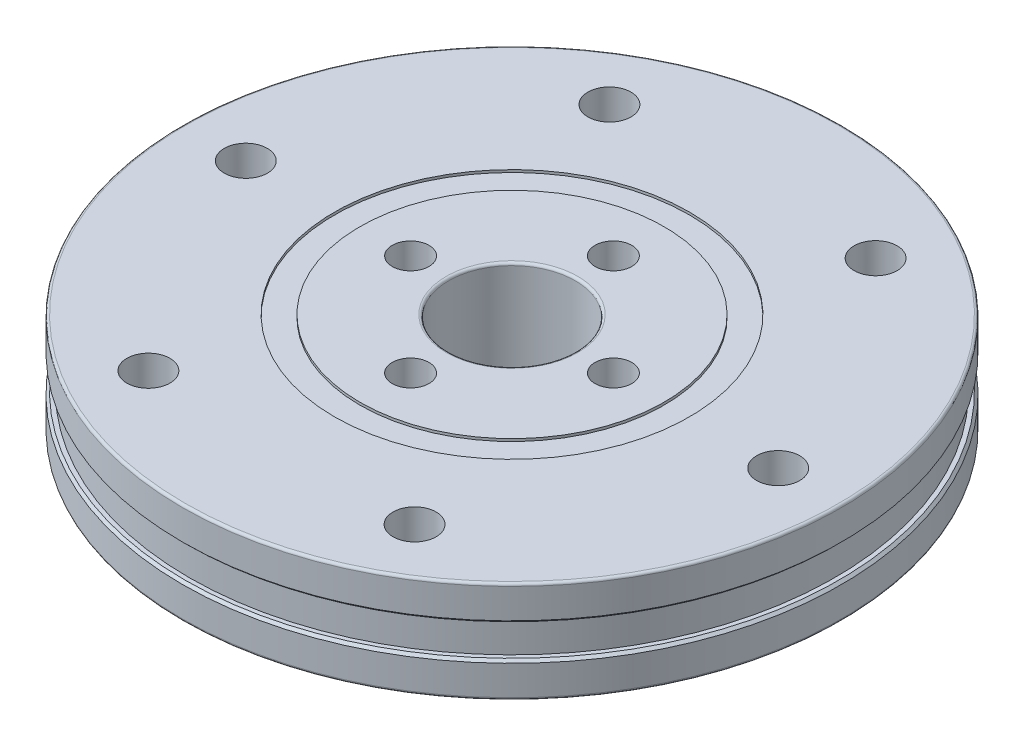
ISO-10303-21;
HEADER;
FILE_DESCRIPTION(('STEP AP214'),'2;1');
FILE_NAME('part.step','',(''),(''),'','','');
FILE_SCHEMA(('AUTOMOTIVE_DESIGN { 1 0 10303 214 1 1 1 1 }'));
ENDSEC;
DATA;
#1=APPLICATION_CONTEXT('core data for automotive mechanical design processes');
#2=APPLICATION_PROTOCOL_DEFINITION('international standard','automotive_design',2000,#1);
#3=PRODUCT_CONTEXT('',#1,'mechanical');
#4=PRODUCT('Part','Part','',(#3));
#5=PRODUCT_RELATED_PRODUCT_CATEGORY('part','',(#4));
#6=PRODUCT_DEFINITION_FORMATION('','',#4);
#7=PRODUCT_DEFINITION_CONTEXT('part definition',#1,'design');
#8=PRODUCT_DEFINITION('design','',#6,#7);
#9=PRODUCT_DEFINITION_SHAPE('','',#8);
#10=(LENGTH_UNIT() NAMED_UNIT(*) SI_UNIT(.MILLI.,.METRE.));
#11=(NAMED_UNIT(*) PLANE_ANGLE_UNIT() SI_UNIT($,.RADIAN.));
#12=(NAMED_UNIT(*) SI_UNIT($,.STERADIAN.) SOLID_ANGLE_UNIT());
#13=UNCERTAINTY_MEASURE_WITH_UNIT(LENGTH_MEASURE(1.E-05),#10,'distance_accuracy_value','');
#14=(GEOMETRIC_REPRESENTATION_CONTEXT(3) GLOBAL_UNCERTAINTY_ASSIGNED_CONTEXT((#13)) GLOBAL_UNIT_ASSIGNED_CONTEXT((#10,
#11,#12)) REPRESENTATION_CONTEXT('',''));
#15=CARTESIAN_POINT('',(0.,0.,0.));
#16=DIRECTION('',(0.,0.,1.));
#17=DIRECTION('',(1.,0.,0.));
#18=AXIS2_PLACEMENT_3D('',#15,#16,#17);
#19=CARTESIAN_POINT('',(10.5,4.,-18.1865334794732));
#20=DIRECTION('',(0.,-1.,0.));
#21=DIRECTION('',(0.,0.,-1.));
#22=AXIS2_PLACEMENT_3D('',#19,#20,#21);
#23=CYLINDRICAL_SURFACE('',#22,1.7);
#24=CARTESIAN_POINT('',(10.5,4.,-18.1865334794732));
#25=DIRECTION('',(0.,1.,0.));
#26=DIRECTION('',(0.,0.,1.));
#27=AXIS2_PLACEMENT_3D('',#24,#25,#26);
#28=CIRCLE('',#27,1.7);
#29=CARTESIAN_POINT('',(10.5,4.,-16.4865334794732));
#30=VERTEX_POINT('',#29);
#31=EDGE_CURVE('E157',#30,#30,#28,.T.);
#32=ORIENTED_EDGE('',*,*,#31,.T.);
#33=EDGE_LOOP('',(#32));
#34=FACE_BOUND('',#33,.T.);
#35=CARTESIAN_POINT('',(10.5,-0.7,-18.1865334794732));
#36=DIRECTION('',(0.,-1.,0.));
#37=DIRECTION('',(0.,0.,-1.));
#38=AXIS2_PLACEMENT_3D('',#35,#36,#37);
#39=CIRCLE('',#38,1.7);
#40=CARTESIAN_POINT('',(10.5,-0.7,-19.8865334794732));
#41=VERTEX_POINT('',#40);
#42=EDGE_CURVE('E52',#41,#41,#39,.T.);
#43=ORIENTED_EDGE('',*,*,#42,.T.);
#44=EDGE_LOOP('',(#43));
#45=FACE_BOUND('',#44,.T.);
#46=ADVANCED_FACE('F48',(#34,#45),#23,.F.);
#47=CARTESIAN_POINT('',(-10.5,4.,-18.1865334794732));
#48=DIRECTION('',(0.,-1.,0.));
#49=DIRECTION('',(0.,0.,-1.));
#50=AXIS2_PLACEMENT_3D('',#47,#48,#49);
#51=CYLINDRICAL_SURFACE('',#50,1.7);
#52=CARTESIAN_POINT('',(-10.5,4.,-18.1865334794732));
#53=DIRECTION('',(0.,1.,0.));
#54=DIRECTION('',(0.,0.,1.));
#55=AXIS2_PLACEMENT_3D('',#52,#53,#54);
#56=CIRCLE('',#55,1.7);
#57=CARTESIAN_POINT('',(-10.5,4.,-16.4865334794732));
#58=VERTEX_POINT('',#57);
#59=EDGE_CURVE('E154',#58,#58,#56,.T.);
#60=ORIENTED_EDGE('',*,*,#59,.T.);
#61=EDGE_LOOP('',(#60));
#62=FACE_BOUND('',#61,.T.);
#63=CARTESIAN_POINT('',(-10.5,-0.7,-18.1865334794732));
#64=DIRECTION('',(0.,-1.,0.));
#65=DIRECTION('',(0.,0.,-1.));
#66=AXIS2_PLACEMENT_3D('',#63,#64,#65);
#67=CIRCLE('',#66,1.7);
#68=CARTESIAN_POINT('',(-10.5,-0.7,-19.8865334794732));
#69=VERTEX_POINT('',#68);
#70=EDGE_CURVE('E77',#69,#69,#67,.T.);
#71=ORIENTED_EDGE('',*,*,#70,.T.);
#72=EDGE_LOOP('',(#71));
#73=FACE_BOUND('',#72,.T.);
#74=ADVANCED_FACE('F217',(#62,#73),#51,.F.);
#75=CARTESIAN_POINT('',(21.,4.,0.));
#76=DIRECTION('',(0.,-1.,0.));
#77=DIRECTION('',(0.,0.,-1.));
#78=AXIS2_PLACEMENT_3D('',#75,#76,#77);
#79=CYLINDRICAL_SURFACE('',#78,1.7);
#80=CARTESIAN_POINT('',(21.,4.,0.));
#81=DIRECTION('',(0.,1.,0.));
#82=DIRECTION('',(0.,0.,1.));
#83=AXIS2_PLACEMENT_3D('',#80,#81,#82);
#84=CIRCLE('',#83,1.7);
#85=CARTESIAN_POINT('',(21.,4.,1.69999999999999));
#86=VERTEX_POINT('',#85);
#87=EDGE_CURVE('E151',#86,#86,#84,.T.);
#88=ORIENTED_EDGE('',*,*,#87,.T.);
#89=EDGE_LOOP('',(#88));
#90=FACE_BOUND('',#89,.T.);
#91=CARTESIAN_POINT('',(21.,-0.7,0.));
#92=DIRECTION('',(0.,-1.,0.));
#93=DIRECTION('',(0.,0.,-1.));
#94=AXIS2_PLACEMENT_3D('',#91,#92,#93);
#95=CIRCLE('',#94,1.7);
#96=CARTESIAN_POINT('',(21.,-0.7,-1.70000000000001));
#97=VERTEX_POINT('',#96);
#98=EDGE_CURVE('E75',#97,#97,#95,.T.);
#99=ORIENTED_EDGE('',*,*,#98,.T.);
#100=EDGE_LOOP('',(#99));
#101=FACE_BOUND('',#100,.T.);
#102=ADVANCED_FACE('F222',(#90,#101),#79,.F.);
#103=CARTESIAN_POINT('',(10.5,4.,18.1865334794732));
#104=DIRECTION('',(0.,-1.,0.));
#105=DIRECTION('',(0.,0.,-1.));
#106=AXIS2_PLACEMENT_3D('',#103,#104,#105);
#107=CYLINDRICAL_SURFACE('',#106,1.7);
#108=CARTESIAN_POINT('',(10.5,4.,18.1865334794732));
#109=DIRECTION('',(0.,1.,0.));
#110=DIRECTION('',(0.,0.,1.));
#111=AXIS2_PLACEMENT_3D('',#108,#109,#110);
#112=CIRCLE('',#111,1.7);
#113=CARTESIAN_POINT('',(10.5,4.,19.8865334794732));
#114=VERTEX_POINT('',#113);
#115=EDGE_CURVE('E148',#114,#114,#112,.T.);
#116=ORIENTED_EDGE('',*,*,#115,.T.);
#117=EDGE_LOOP('',(#116));
#118=FACE_BOUND('',#117,.T.);
#119=CARTESIAN_POINT('',(10.5,-0.7,18.1865334794732));
#120=DIRECTION('',(0.,-1.,0.));
#121=DIRECTION('',(0.,0.,-1.));
#122=AXIS2_PLACEMENT_3D('',#119,#120,#121);
#123=CIRCLE('',#122,1.7);
#124=CARTESIAN_POINT('',(10.5,-0.7,16.4865334794732));
#125=VERTEX_POINT('',#124);
#126=EDGE_CURVE('E72',#125,#125,#123,.T.);
#127=ORIENTED_EDGE('',*,*,#126,.T.);
#128=EDGE_LOOP('',(#127));
#129=FACE_BOUND('',#128,.T.);
#130=ADVANCED_FACE('F228',(#118,#129),#107,.F.);
#131=CARTESIAN_POINT('',(-10.5,4.,18.1865334794732));
#132=DIRECTION('',(0.,-1.,0.));
#133=DIRECTION('',(0.,0.,-1.));
#134=AXIS2_PLACEMENT_3D('',#131,#132,#133);
#135=CYLINDRICAL_SURFACE('',#134,1.7);
#136=CARTESIAN_POINT('',(-10.5,4.,18.1865334794732));
#137=DIRECTION('',(0.,1.,0.));
#138=DIRECTION('',(0.,0.,1.));
#139=AXIS2_PLACEMENT_3D('',#136,#137,#138);
#140=CIRCLE('',#139,1.7);
#141=CARTESIAN_POINT('',(-10.5,4.,19.8865334794732));
#142=VERTEX_POINT('',#141);
#143=EDGE_CURVE('E145',#142,#142,#140,.T.);
#144=ORIENTED_EDGE('',*,*,#143,.T.);
#145=EDGE_LOOP('',(#144));
#146=FACE_BOUND('',#145,.T.);
#147=CARTESIAN_POINT('',(-10.5,-0.7,18.1865334794732));
#148=DIRECTION('',(0.,-1.,0.));
#149=DIRECTION('',(0.,0.,-1.));
#150=AXIS2_PLACEMENT_3D('',#147,#148,#149);
#151=CIRCLE('',#150,1.7);
#152=CARTESIAN_POINT('',(-10.5,-0.7,16.4865334794732));
#153=VERTEX_POINT('',#152);
#154=EDGE_CURVE('E68',#153,#153,#151,.T.);
#155=ORIENTED_EDGE('',*,*,#154,.T.);
#156=EDGE_LOOP('',(#155));
#157=FACE_BOUND('',#156,.T.);
#158=ADVANCED_FACE('F232',(#146,#157),#135,.F.);
#159=CARTESIAN_POINT('',(-21.,4.,0.));
#160=DIRECTION('',(0.,-1.,0.));
#161=DIRECTION('',(0.,0.,-1.));
#162=AXIS2_PLACEMENT_3D('',#159,#160,#161);
#163=CYLINDRICAL_SURFACE('',#162,1.7);
#164=CARTESIAN_POINT('',(-21.,4.,0.));
#165=DIRECTION('',(0.,1.,0.));
#166=DIRECTION('',(0.,0.,1.));
#167=AXIS2_PLACEMENT_3D('',#164,#165,#166);
#168=CIRCLE('',#167,1.7);
#169=CARTESIAN_POINT('',(-21.,4.,1.7));
#170=VERTEX_POINT('',#169);
#171=EDGE_CURVE('E140',#170,#170,#168,.T.);
#172=ORIENTED_EDGE('',*,*,#171,.T.);
#173=EDGE_LOOP('',(#172));
#174=FACE_BOUND('',#173,.T.);
#175=CARTESIAN_POINT('',(-21.,-0.7,0.));
#176=DIRECTION('',(0.,-1.,0.));
#177=DIRECTION('',(0.,0.,-1.));
#178=AXIS2_PLACEMENT_3D('',#175,#176,#177);
#179=CIRCLE('',#178,1.7);
#180=CARTESIAN_POINT('',(-21.,-0.7,-1.7));
#181=VERTEX_POINT('',#180);
#182=EDGE_CURVE('E65',#181,#181,#179,.T.);
#183=ORIENTED_EDGE('',*,*,#182,.T.);
#184=EDGE_LOOP('',(#183));
#185=FACE_BOUND('',#184,.T.);
#186=ADVANCED_FACE('F236',(#174,#185),#163,.F.);
#187=CARTESIAN_POINT('',(0.,4.,0.));
#188=DIRECTION('',(0.,-1.,0.));
#189=DIRECTION('',(0.,0.,-1.));
#190=AXIS2_PLACEMENT_3D('',#187,#188,#189);
#191=CYLINDRICAL_SURFACE('',#190,26.);
#192=CARTESIAN_POINT('',(0.,-3.8,0.));
#193=DIRECTION('',(0.,1.,0.));
#194=DIRECTION('',(0.,0.,1.));
#195=AXIS2_PLACEMENT_3D('',#192,#193,#194);
#196=CIRCLE('',#195,26.);
#197=CARTESIAN_POINT('',(0.,-3.8,26.));
#198=VERTEX_POINT('',#197);
#199=EDGE_CURVE('E181',#198,#198,#196,.T.);
#200=ORIENTED_EDGE('',*,*,#199,.T.);
#201=EDGE_LOOP('',(#200));
#202=FACE_BOUND('',#201,.T.);
#203=CARTESIAN_POINT('',(0.,-1.45,0.));
#204=DIRECTION('',(0.,1.,0.));
#205=DIRECTION('',(0.,0.,1.));
#206=AXIS2_PLACEMENT_3D('',#203,#204,#205);
#207=CIRCLE('',#206,26.);
#208=CARTESIAN_POINT('',(0.,-1.45,26.));
#209=VERTEX_POINT('',#208);
#210=EDGE_CURVE('E163',#209,#209,#207,.F.);
#211=ORIENTED_EDGE('',*,*,#210,.T.);
#212=EDGE_LOOP('',(#211));
#213=FACE_BOUND('',#212,.T.);
#214=ADVANCED_FACE('F213',(#202,#213),#191,.T.);
#215=CARTESIAN_POINT('',(0.,-4.,0.));
#216=DIRECTION('',(0.,1.,0.));
#217=DIRECTION('',(0.,0.,1.));
#218=AXIS2_PLACEMENT_3D('',#215,#216,#217);
#219=PLANE('',#218);
#220=CARTESIAN_POINT('',(0.,-4.,0.));
#221=DIRECTION('',(0.,1.,0.));
#222=DIRECTION('',(0.,0.,1.));
#223=AXIS2_PLACEMENT_3D('',#220,#221,#222);
#224=CIRCLE('',#223,5.2);
#225=CARTESIAN_POINT('',(0.,-4.,5.2));
#226=VERTEX_POINT('',#225);
#227=EDGE_CURVE('E172',#226,#226,#224,.T.);
#228=ORIENTED_EDGE('',*,*,#227,.T.);
#229=EDGE_LOOP('',(#228));
#230=FACE_BOUND('',#229,.T.);
#231=CARTESIAN_POINT('',(-7.99999999999999,-4.,0.));
#232=DIRECTION('',(0.,1.,0.));
#233=DIRECTION('',(0.,0.,1.));
#234=AXIS2_PLACEMENT_3D('',#231,#232,#233);
#235=CIRCLE('',#234,1.45);
#236=CARTESIAN_POINT('',(-7.99999999999999,-4.,1.45));
#237=VERTEX_POINT('',#236);
#238=EDGE_CURVE('E116',#237,#237,#235,.T.);
#239=ORIENTED_EDGE('',*,*,#238,.T.);
#240=EDGE_LOOP('',(#239));
#241=FACE_BOUND('',#240,.T.);
#242=CARTESIAN_POINT('',(0.,-4.,8.));
#243=DIRECTION('',(0.,1.,0.));
#244=DIRECTION('',(0.,0.,1.));
#245=AXIS2_PLACEMENT_3D('',#242,#243,#244);
#246=CIRCLE('',#245,1.45);
#247=CARTESIAN_POINT('',(0.,-4.,9.45));
#248=VERTEX_POINT('',#247);
#249=EDGE_CURVE('E122',#248,#248,#246,.T.);
#250=ORIENTED_EDGE('',*,*,#249,.T.);
#251=EDGE_LOOP('',(#250));
#252=FACE_BOUND('',#251,.T.);
#253=CARTESIAN_POINT('',(0.,-4.,-7.99999999999999));
#254=DIRECTION('',(0.,1.,0.));
#255=DIRECTION('',(0.,0.,1.));
#256=AXIS2_PLACEMENT_3D('',#253,#254,#255);
#257=CIRCLE('',#256,1.45);
#258=CARTESIAN_POINT('',(0.,-4.,-6.54999999999999));
#259=VERTEX_POINT('',#258);
#260=EDGE_CURVE('E128',#259,#259,#257,.T.);
#261=ORIENTED_EDGE('',*,*,#260,.T.);
#262=EDGE_LOOP('',(#261));
#263=FACE_BOUND('',#262,.T.);
#264=CARTESIAN_POINT('',(7.99999999999999,-4.,0.));
#265=DIRECTION('',(0.,1.,0.));
#266=DIRECTION('',(0.,0.,1.));
#267=AXIS2_PLACEMENT_3D('',#264,#265,#266);
#268=CIRCLE('',#267,1.45);
#269=CARTESIAN_POINT('',(7.99999999999999,-4.,1.45000000000001));
#270=VERTEX_POINT('',#269);
#271=EDGE_CURVE('E134',#270,#270,#268,.T.);
#272=ORIENTED_EDGE('',*,*,#271,.T.);
#273=EDGE_LOOP('',(#272));
#274=FACE_BOUND('',#273,.T.);
#275=CARTESIAN_POINT('',(0.,-4.,0.));
#276=DIRECTION('',(0.,-1.,0.));
#277=DIRECTION('',(0.,0.,-1.));
#278=AXIS2_PLACEMENT_3D('',#275,#276,#277);
#279=CIRCLE('',#278,12.);
#280=CARTESIAN_POINT('',(0.,-4.,-12.));
#281=VERTEX_POINT('',#280);
#282=EDGE_CURVE('E91',#281,#281,#279,.T.);
#283=ORIENTED_EDGE('',*,*,#282,.T.);
#284=EDGE_LOOP('',(#283));
#285=FACE_BOUND('',#284,.T.);
#286=ADVANCED_FACE('F383',(#230,#241,#252,#263,#274,#285),#219,.F.);
#287=CARTESIAN_POINT('',(0.,4.,0.));
#288=DIRECTION('',(0.,1.,0.));
#289=DIRECTION('',(0.,0.,1.));
#290=AXIS2_PLACEMENT_3D('',#287,#288,#289);
#291=PLANE('',#290);
#292=CARTESIAN_POINT('',(0.,4.,0.));
#293=DIRECTION('',(0.,1.,0.));
#294=DIRECTION('',(0.,0.,1.));
#295=AXIS2_PLACEMENT_3D('',#292,#293,#294);
#296=CIRCLE('',#295,5.2);
#297=CARTESIAN_POINT('',(0.,4.,5.2));
#298=VERTEX_POINT('',#297);
#299=EDGE_CURVE('E61',#298,#298,#296,.F.);
#300=ORIENTED_EDGE('',*,*,#299,.T.);
#301=EDGE_LOOP('',(#300));
#302=FACE_BOUND('',#301,.T.);
#303=CARTESIAN_POINT('',(-7.99999999999999,4.,0.));
#304=DIRECTION('',(0.,1.,0.));
#305=DIRECTION('',(0.,0.,1.));
#306=AXIS2_PLACEMENT_3D('',#303,#304,#305);
#307=CIRCLE('',#306,1.45);
#308=CARTESIAN_POINT('',(-7.99999999999999,4.,1.45));
#309=VERTEX_POINT('',#308);
#310=EDGE_CURVE('E119',#309,#309,#307,.T.);
#311=ORIENTED_EDGE('',*,*,#310,.F.);
#312=EDGE_LOOP('',(#311));
#313=FACE_BOUND('',#312,.T.);
#314=CARTESIAN_POINT('',(0.,4.,-7.99999999999999));
#315=DIRECTION('',(0.,1.,0.));
#316=DIRECTION('',(0.,0.,1.));
#317=AXIS2_PLACEMENT_3D('',#314,#315,#316);
#318=CIRCLE('',#317,1.45);
#319=CARTESIAN_POINT('',(0.,4.,-6.54999999999999));
#320=VERTEX_POINT('',#319);
#321=EDGE_CURVE('E131',#320,#320,#318,.T.);
#322=ORIENTED_EDGE('',*,*,#321,.F.);
#323=EDGE_LOOP('',(#322));
#324=FACE_BOUND('',#323,.T.);
#325=CARTESIAN_POINT('',(7.99999999999999,4.,0.));
#326=DIRECTION('',(0.,1.,0.));
#327=DIRECTION('',(0.,0.,1.));
#328=AXIS2_PLACEMENT_3D('',#325,#326,#327);
#329=CIRCLE('',#328,1.45);
#330=CARTESIAN_POINT('',(7.99999999999999,4.,1.45000000000001));
#331=VERTEX_POINT('',#330);
#332=EDGE_CURVE('E137',#331,#331,#329,.T.);
#333=ORIENTED_EDGE('',*,*,#332,.F.);
#334=EDGE_LOOP('',(#333));
#335=FACE_BOUND('',#334,.T.);
#336=CARTESIAN_POINT('',(0.,4.,8.));
#337=DIRECTION('',(0.,1.,0.));
#338=DIRECTION('',(0.,0.,1.));
#339=AXIS2_PLACEMENT_3D('',#336,#337,#338);
#340=CIRCLE('',#339,1.45);
#341=CARTESIAN_POINT('',(0.,4.,9.45));
#342=VERTEX_POINT('',#341);
#343=EDGE_CURVE('E125',#342,#342,#340,.T.);
#344=ORIENTED_EDGE('',*,*,#343,.F.);
#345=EDGE_LOOP('',(#344));
#346=FACE_BOUND('',#345,.T.);
#347=CARTESIAN_POINT('',(0.,4.,0.));
#348=DIRECTION('',(0.,1.,0.));
#349=DIRECTION('',(0.,0.,1.));
#350=AXIS2_PLACEMENT_3D('',#347,#348,#349);
#351=CIRCLE('',#350,12.);
#352=CARTESIAN_POINT('',(0.,4.,12.));
#353=VERTEX_POINT('',#352);
#354=EDGE_CURVE('E104',#353,#353,#351,.T.);
#355=ORIENTED_EDGE('',*,*,#354,.T.);
#356=EDGE_LOOP('',(#355));
#357=FACE_BOUND('',#356,.T.);
#358=ADVANCED_FACE('F189',(#302,#313,#324,#335,#346,#357),#291,.T.);
#359=CARTESIAN_POINT('',(0.,4.,0.));
#360=DIRECTION('',(0.,1.,0.));
#361=DIRECTION('',(0.,0.,1.));
#362=AXIS2_PLACEMENT_3D('',#359,#360,#361);
#363=CIRCLE('',#362,25.8);
#364=CARTESIAN_POINT('',(0.,4.,25.8));
#365=VERTEX_POINT('',#364);
#366=EDGE_CURVE('E56',#365,#365,#363,.T.);
#367=ORIENTED_EDGE('',*,*,#366,.T.);
#368=EDGE_LOOP('',(#367));
#369=FACE_BOUND('',#368,.T.);
#370=CARTESIAN_POINT('',(0.,4.,0.));
#371=DIRECTION('',(0.,1.,0.));
#372=DIRECTION('',(0.,0.,1.));
#373=AXIS2_PLACEMENT_3D('',#370,#371,#372);
#374=CIRCLE('',#373,14.);
#375=CARTESIAN_POINT('',(0.,4.,14.));
#376=VERTEX_POINT('',#375);
#377=EDGE_CURVE('E110',#376,#376,#374,.T.);
#378=ORIENTED_EDGE('',*,*,#377,.F.);
#379=EDGE_LOOP('',(#378));
#380=FACE_BOUND('',#379,.T.);
#381=ORIENTED_EDGE('',*,*,#143,.F.);
#382=EDGE_LOOP('',(#381));
#383=FACE_BOUND('',#382,.T.);
#384=ORIENTED_EDGE('',*,*,#87,.F.);
#385=EDGE_LOOP('',(#384));
#386=FACE_BOUND('',#385,.T.);
#387=ORIENTED_EDGE('',*,*,#31,.F.);
#388=EDGE_LOOP('',(#387));
#389=FACE_BOUND('',#388,.T.);
#390=ORIENTED_EDGE('',*,*,#59,.F.);
#391=EDGE_LOOP('',(#390));
#392=FACE_BOUND('',#391,.T.);
#393=ORIENTED_EDGE('',*,*,#115,.F.);
#394=EDGE_LOOP('',(#393));
#395=FACE_BOUND('',#394,.T.);
#396=ORIENTED_EDGE('',*,*,#171,.F.);
#397=EDGE_LOOP('',(#396));
#398=FACE_BOUND('',#397,.T.);
#399=ADVANCED_FACE('F380',(#369,#380,#383,#386,#389,#392,#395,#398),#291,.T.);
#400=CARTESIAN_POINT('',(-21.,-4.,0.));
#401=DIRECTION('',(0.,-1.,0.));
#402=DIRECTION('',(0.,0.,-1.));
#403=AXIS2_PLACEMENT_3D('',#400,#401,#402);
#404=CIRCLE('',#403,3.25);
#405=CARTESIAN_POINT('',(-21.,-4.,-3.25));
#406=VERTEX_POINT('',#405);
#407=EDGE_CURVE('E342',#406,#406,#404,.T.);
#408=ORIENTED_EDGE('',*,*,#407,.F.);
#409=EDGE_LOOP('',(#408));
#410=FACE_BOUND('',#409,.T.);
#411=CARTESIAN_POINT('',(-10.5,-4.,18.1865334794732));
#412=DIRECTION('',(0.,-1.,0.));
#413=DIRECTION('',(0.,0.,-1.));
#414=AXIS2_PLACEMENT_3D('',#411,#412,#413);
#415=CIRCLE('',#414,3.25);
#416=CARTESIAN_POINT('',(-10.5,-4.,14.9365334794732));
#417=VERTEX_POINT('',#416);
#418=EDGE_CURVE('E352',#417,#417,#415,.T.);
#419=ORIENTED_EDGE('',*,*,#418,.F.);
#420=EDGE_LOOP('',(#419));
#421=FACE_BOUND('',#420,.T.);
#422=CARTESIAN_POINT('',(10.5,-4.,18.1865334794732));
#423=DIRECTION('',(0.,-1.,0.));
#424=DIRECTION('',(0.,0.,-1.));
#425=AXIS2_PLACEMENT_3D('',#422,#423,#424);
#426=CIRCLE('',#425,3.25);
#427=CARTESIAN_POINT('',(10.5,-4.,14.9365334794732));
#428=VERTEX_POINT('',#427);
#429=EDGE_CURVE('E351',#428,#428,#426,.T.);
#430=ORIENTED_EDGE('',*,*,#429,.F.);
#431=EDGE_LOOP('',(#430));
#432=FACE_BOUND('',#431,.T.);
#433=CARTESIAN_POINT('',(21.,-4.,0.));
#434=DIRECTION('',(0.,-1.,0.));
#435=DIRECTION('',(0.,0.,-1.));
#436=AXIS2_PLACEMENT_3D('',#433,#434,#435);
#437=CIRCLE('',#436,3.25);
#438=CARTESIAN_POINT('',(21.,-4.,-3.25000000000001));
#439=VERTEX_POINT('',#438);
#440=EDGE_CURVE('E369',#439,#439,#437,.T.);
#441=ORIENTED_EDGE('',*,*,#440,.F.);
#442=EDGE_LOOP('',(#441));
#443=FACE_BOUND('',#442,.T.);
#444=CARTESIAN_POINT('',(10.5,-4.,-18.1865334794732));
#445=DIRECTION('',(0.,-1.,0.));
#446=DIRECTION('',(0.,0.,-1.));
#447=AXIS2_PLACEMENT_3D('',#444,#445,#446);
#448=CIRCLE('',#447,3.25);
#449=CARTESIAN_POINT('',(10.5,-4.,-21.4365334794732));
#450=VERTEX_POINT('',#449);
#451=EDGE_CURVE('E363',#450,#450,#448,.T.);
#452=ORIENTED_EDGE('',*,*,#451,.F.);
#453=EDGE_LOOP('',(#452));
#454=FACE_BOUND('',#453,.T.);
#455=CARTESIAN_POINT('',(-10.5,-4.,-18.1865334794732));
#456=DIRECTION('',(0.,-1.,0.));
#457=DIRECTION('',(0.,0.,-1.));
#458=AXIS2_PLACEMENT_3D('',#455,#456,#457);
#459=CIRCLE('',#458,3.25);
#460=CARTESIAN_POINT('',(-10.5,-4.,-21.4365334794732));
#461=VERTEX_POINT('',#460);
#462=EDGE_CURVE('E357',#461,#461,#459,.T.);
#463=ORIENTED_EDGE('',*,*,#462,.F.);
#464=EDGE_LOOP('',(#463));
#465=FACE_BOUND('',#464,.T.);
#466=CARTESIAN_POINT('',(0.,-4.,0.));
#467=DIRECTION('',(0.,1.,0.));
#468=DIRECTION('',(0.,0.,1.));
#469=AXIS2_PLACEMENT_3D('',#466,#467,#468);
#470=CIRCLE('',#469,25.8);
#471=CARTESIAN_POINT('',(0.,-4.,25.8));
#472=VERTEX_POINT('',#471);
#473=EDGE_CURVE('E184',#472,#472,#470,.F.);
#474=ORIENTED_EDGE('',*,*,#473,.T.);
#475=EDGE_LOOP('',(#474));
#476=FACE_BOUND('',#475,.T.);
#477=CARTESIAN_POINT('',(0.,-4.,0.));
#478=DIRECTION('',(0.,-1.,0.));
#479=DIRECTION('',(0.,0.,-1.));
#480=AXIS2_PLACEMENT_3D('',#477,#478,#479);
#481=CIRCLE('',#480,14.);
#482=CARTESIAN_POINT('',(0.,-4.,-14.));
#483=VERTEX_POINT('',#482);
#484=EDGE_CURVE('E98',#483,#483,#481,.T.);
#485=ORIENTED_EDGE('',*,*,#484,.F.);
#486=EDGE_LOOP('',(#485));
#487=FACE_BOUND('',#486,.T.);
#488=ADVANCED_FACE('F211',(#410,#421,#432,#443,#454,#465,#476,#487),#219,.F.);
#489=CARTESIAN_POINT('',(0.,3.8,0.));
#490=DIRECTION('',(0.,1.,0.));
#491=DIRECTION('',(0.,0.,1.));
#492=AXIS2_PLACEMENT_3D('',#489,#490,#491);
#493=CIRCLE('',#492,26.);
#494=CARTESIAN_POINT('',(0.,3.8,26.));
#495=VERTEX_POINT('',#494);
#496=EDGE_CURVE('E11',#495,#495,#493,.F.);
#497=ORIENTED_EDGE('',*,*,#496,.T.);
#498=EDGE_LOOP('',(#497));
#499=FACE_BOUND('',#498,.T.);
#500=CARTESIAN_POINT('',(0.,1.45,0.));
#501=DIRECTION('',(0.,1.,0.));
#502=DIRECTION('',(0.,0.,1.));
#503=AXIS2_PLACEMENT_3D('',#500,#501,#502);
#504=CIRCLE('',#503,26.);
#505=CARTESIAN_POINT('',(0.,1.45,26.));
#506=VERTEX_POINT('',#505);
#507=EDGE_CURVE('E166',#506,#506,#504,.T.);
#508=ORIENTED_EDGE('',*,*,#507,.T.);
#509=EDGE_LOOP('',(#508));
#510=FACE_BOUND('',#509,.T.);
#511=ADVANCED_FACE('F201',(#499,#510),#191,.T.);
#512=CARTESIAN_POINT('',(0.,4.,0.));
#513=DIRECTION('',(0.,-1.,0.));
#514=DIRECTION('',(0.,0.,-1.));
#515=AXIS2_PLACEMENT_3D('',#512,#513,#514);
#516=CYLINDRICAL_SURFACE('',#515,5.);
#517=CARTESIAN_POINT('',(0.,-3.8,0.));
#518=DIRECTION('',(0.,1.,0.));
#519=DIRECTION('',(0.,0.,1.));
#520=AXIS2_PLACEMENT_3D('',#517,#518,#519);
#521=CIRCLE('',#520,5.);
#522=CARTESIAN_POINT('',(0.,-3.8,5.));
#523=VERTEX_POINT('',#522);
#524=EDGE_CURVE('E178',#523,#523,#521,.F.);
#525=ORIENTED_EDGE('',*,*,#524,.T.);
#526=EDGE_LOOP('',(#525));
#527=FACE_BOUND('',#526,.T.);
#528=CARTESIAN_POINT('',(0.,3.8,0.));
#529=DIRECTION('',(0.,1.,0.));
#530=DIRECTION('',(0.,0.,1.));
#531=AXIS2_PLACEMENT_3D('',#528,#529,#530);
#532=CIRCLE('',#531,5.);
#533=CARTESIAN_POINT('',(0.,3.8,5.));
#534=VERTEX_POINT('',#533);
#535=EDGE_CURVE('E175',#534,#534,#532,.T.);
#536=ORIENTED_EDGE('',*,*,#535,.T.);
#537=EDGE_LOOP('',(#536));
#538=FACE_BOUND('',#537,.T.);
#539=ADVANCED_FACE('F198',(#527,#538),#516,.F.);
#540=CARTESIAN_POINT('',(7.99999999999999,4.,0.));
#541=DIRECTION('',(0.,-1.,0.));
#542=DIRECTION('',(0.,0.,-1.));
#543=AXIS2_PLACEMENT_3D('',#540,#541,#542);
#544=CYLINDRICAL_SURFACE('',#543,1.45);
#545=ORIENTED_EDGE('',*,*,#332,.T.);
#546=EDGE_LOOP('',(#545));
#547=FACE_BOUND('',#546,.T.);
#548=ORIENTED_EDGE('',*,*,#271,.F.);
#549=EDGE_LOOP('',(#548));
#550=FACE_BOUND('',#549,.T.);
#551=ADVANCED_FACE('F200',(#547,#550),#544,.F.);
#552=CARTESIAN_POINT('',(0.,4.,-7.99999999999999));
#553=DIRECTION('',(0.,-1.,0.));
#554=DIRECTION('',(0.,0.,-1.));
#555=AXIS2_PLACEMENT_3D('',#552,#553,#554);
#556=CYLINDRICAL_SURFACE('',#555,1.45);
#557=ORIENTED_EDGE('',*,*,#321,.T.);
#558=EDGE_LOOP('',(#557));
#559=FACE_BOUND('',#558,.T.);
#560=ORIENTED_EDGE('',*,*,#260,.F.);
#561=EDGE_LOOP('',(#560));
#562=FACE_BOUND('',#561,.T.);
#563=ADVANCED_FACE('F208',(#559,#562),#556,.F.);
#564=CARTESIAN_POINT('',(0.,4.,8.));
#565=DIRECTION('',(0.,-1.,0.));
#566=DIRECTION('',(0.,0.,-1.));
#567=AXIS2_PLACEMENT_3D('',#564,#565,#566);
#568=CYLINDRICAL_SURFACE('',#567,1.45);
#569=ORIENTED_EDGE('',*,*,#343,.T.);
#570=EDGE_LOOP('',(#569));
#571=FACE_BOUND('',#570,.T.);
#572=ORIENTED_EDGE('',*,*,#249,.F.);
#573=EDGE_LOOP('',(#572));
#574=FACE_BOUND('',#573,.T.);
#575=ADVANCED_FACE('F243',(#571,#574),#568,.F.);
#576=CARTESIAN_POINT('',(-7.99999999999999,4.,0.));
#577=DIRECTION('',(0.,-1.,0.));
#578=DIRECTION('',(0.,0.,-1.));
#579=AXIS2_PLACEMENT_3D('',#576,#577,#578);
#580=CYLINDRICAL_SURFACE('',#579,1.45);
#581=ORIENTED_EDGE('',*,*,#310,.T.);
#582=EDGE_LOOP('',(#581));
#583=FACE_BOUND('',#582,.T.);
#584=ORIENTED_EDGE('',*,*,#238,.F.);
#585=EDGE_LOOP('',(#584));
#586=FACE_BOUND('',#585,.T.);
#587=ADVANCED_FACE('F247',(#583,#586),#580,.F.);
#588=CARTESIAN_POINT('',(0.,3.8,0.));
#589=DIRECTION('',(0.,1.,0.));
#590=DIRECTION('',(0.,0.,1.));
#591=AXIS2_PLACEMENT_3D('',#588,#589,#590);
#592=CYLINDRICAL_SURFACE('',#591,14.);
#593=CARTESIAN_POINT('',(0.,3.8,0.));
#594=DIRECTION('',(0.,1.,0.));
#595=DIRECTION('',(0.,0.,1.));
#596=AXIS2_PLACEMENT_3D('',#593,#594,#595);
#597=CIRCLE('',#596,14.);
#598=CARTESIAN_POINT('',(0.,3.8,14.));
#599=VERTEX_POINT('',#598);
#600=EDGE_CURVE('E113',#599,#599,#597,.T.);
#601=ORIENTED_EDGE('',*,*,#600,.F.);
#602=EDGE_LOOP('',(#601));
#603=FACE_BOUND('',#602,.T.);
#604=ORIENTED_EDGE('',*,*,#377,.T.);
#605=EDGE_LOOP('',(#604));
#606=FACE_BOUND('',#605,.T.);
#607=ADVANCED_FACE('F251',(#603,#606),#592,.F.);
#608=CARTESIAN_POINT('',(0.,3.8,0.));
#609=DIRECTION('',(0.,1.,0.));
#610=DIRECTION('',(0.,0.,1.));
#611=AXIS2_PLACEMENT_3D('',#608,#609,#610);
#612=PLANE('',#611);
#613=CARTESIAN_POINT('',(0.,3.8,0.));
#614=DIRECTION('',(0.,1.,0.));
#615=DIRECTION('',(0.,0.,1.));
#616=AXIS2_PLACEMENT_3D('',#613,#614,#615);
#617=CIRCLE('',#616,12.);
#618=CARTESIAN_POINT('',(0.,3.8,12.));
#619=VERTEX_POINT('',#618);
#620=EDGE_CURVE('E107',#619,#619,#617,.T.);
#621=ORIENTED_EDGE('',*,*,#620,.F.);
#622=EDGE_LOOP('',(#621));
#623=FACE_BOUND('',#622,.T.);
#624=ORIENTED_EDGE('',*,*,#600,.T.);
#625=EDGE_LOOP('',(#624));
#626=FACE_BOUND('',#625,.T.);
#627=ADVANCED_FACE('F255',(#623,#626),#612,.T.);
#628=CARTESIAN_POINT('',(0.,3.8,0.));
#629=DIRECTION('',(0.,1.,0.));
#630=DIRECTION('',(0.,0.,1.));
#631=AXIS2_PLACEMENT_3D('',#628,#629,#630);
#632=CYLINDRICAL_SURFACE('',#631,12.);
#633=ORIENTED_EDGE('',*,*,#620,.T.);
#634=EDGE_LOOP('',(#633));
#635=FACE_BOUND('',#634,.T.);
#636=ORIENTED_EDGE('',*,*,#354,.F.);
#637=EDGE_LOOP('',(#636));
#638=FACE_BOUND('',#637,.T.);
#639=ADVANCED_FACE('F259',(#635,#638),#632,.T.);
#640=CARTESIAN_POINT('',(0.,-3.8,0.));
#641=DIRECTION('',(0.,-1.,0.));
#642=DIRECTION('',(0.,0.,-1.));
#643=AXIS2_PLACEMENT_3D('',#640,#641,#642);
#644=CYLINDRICAL_SURFACE('',#643,14.);
#645=CARTESIAN_POINT('',(0.,-3.8,0.));
#646=DIRECTION('',(0.,-1.,0.));
#647=DIRECTION('',(0.,0.,-1.));
#648=AXIS2_PLACEMENT_3D('',#645,#646,#647);
#649=CIRCLE('',#648,14.);
#650=CARTESIAN_POINT('',(0.,-3.8,-14.));
#651=VERTEX_POINT('',#650);
#652=EDGE_CURVE('E101',#651,#651,#649,.T.);
#653=ORIENTED_EDGE('',*,*,#652,.F.);
#654=EDGE_LOOP('',(#653));
#655=FACE_BOUND('',#654,.T.);
#656=ORIENTED_EDGE('',*,*,#484,.T.);
#657=EDGE_LOOP('',(#656));
#658=FACE_BOUND('',#657,.T.);
#659=ADVANCED_FACE('F263',(#655,#658),#644,.F.);
#660=CARTESIAN_POINT('',(0.,-3.8,0.));
#661=DIRECTION('',(0.,-1.,0.));
#662=DIRECTION('',(0.,0.,-1.));
#663=AXIS2_PLACEMENT_3D('',#660,#661,#662);
#664=PLANE('',#663);
#665=CARTESIAN_POINT('',(0.,-3.8,0.));
#666=DIRECTION('',(0.,-1.,0.));
#667=DIRECTION('',(0.,0.,-1.));
#668=AXIS2_PLACEMENT_3D('',#665,#666,#667);
#669=CIRCLE('',#668,12.);
#670=CARTESIAN_POINT('',(0.,-3.8,-12.));
#671=VERTEX_POINT('',#670);
#672=EDGE_CURVE('E95',#671,#671,#669,.T.);
#673=ORIENTED_EDGE('',*,*,#672,.F.);
#674=EDGE_LOOP('',(#673));
#675=FACE_BOUND('',#674,.T.);
#676=ORIENTED_EDGE('',*,*,#652,.T.);
#677=EDGE_LOOP('',(#676));
#678=FACE_BOUND('',#677,.T.);
#679=ADVANCED_FACE('F267',(#675,#678),#664,.T.);
#680=CARTESIAN_POINT('',(0.,-3.8,0.));
#681=DIRECTION('',(0.,-1.,0.));
#682=DIRECTION('',(0.,0.,-1.));
#683=AXIS2_PLACEMENT_3D('',#680,#681,#682);
#684=CYLINDRICAL_SURFACE('',#683,12.);
#685=ORIENTED_EDGE('',*,*,#672,.T.);
#686=EDGE_LOOP('',(#685));
#687=FACE_BOUND('',#686,.T.);
#688=ORIENTED_EDGE('',*,*,#282,.F.);
#689=EDGE_LOOP('',(#688));
#690=FACE_BOUND('',#689,.T.);
#691=ADVANCED_FACE('F271',(#687,#690),#684,.T.);
#692=CARTESIAN_POINT('',(0.,-1.25,0.));
#693=DIRECTION('',(0.,1.,0.));
#694=DIRECTION('',(0.,0.,1.));
#695=AXIS2_PLACEMENT_3D('',#692,#693,#694);
#696=PLANE('',#695);
#697=CARTESIAN_POINT('',(0.,-1.25,0.));
#698=DIRECTION('',(0.,1.,0.));
#699=DIRECTION('',(0.,0.,1.));
#700=AXIS2_PLACEMENT_3D('',#697,#698,#699);
#701=CIRCLE('',#700,25.8);
#702=CARTESIAN_POINT('',(0.,-1.25,25.8));
#703=VERTEX_POINT('',#702);
#704=EDGE_CURVE('E160',#703,#703,#701,.T.);
#705=ORIENTED_EDGE('',*,*,#704,.T.);
#706=EDGE_LOOP('',(#705));
#707=FACE_BOUND('',#706,.T.);
#708=CARTESIAN_POINT('',(0.,-1.25,0.));
#709=DIRECTION('',(0.,1.,0.));
#710=DIRECTION('',(0.,0.,1.));
#711=AXIS2_PLACEMENT_3D('',#708,#709,#710);
#712=CIRCLE('',#711,25.4684345101907);
#713=CARTESIAN_POINT('',(0.,-1.25,25.4684345101907));
#714=VERTEX_POINT('',#713);
#715=EDGE_CURVE('E86',#714,#714,#712,.T.);
#716=ORIENTED_EDGE('',*,*,#715,.F.);
#717=EDGE_LOOP('',(#716));
#718=FACE_BOUND('',#717,.T.);
#719=ADVANCED_FACE('F275',(#707,#718),#696,.T.);
#720=CARTESIAN_POINT('',(0.,1.25,0.));
#721=DIRECTION('',(0.,1.,0.));
#722=DIRECTION('',(0.,0.,1.));
#723=AXIS2_PLACEMENT_3D('',#720,#721,#722);
#724=PLANE('',#723);
#725=CARTESIAN_POINT('',(0.,1.25,0.));
#726=DIRECTION('',(0.,1.,0.));
#727=DIRECTION('',(0.,0.,1.));
#728=AXIS2_PLACEMENT_3D('',#725,#726,#727);
#729=CIRCLE('',#728,25.8);
#730=CARTESIAN_POINT('',(0.,1.25,25.8));
#731=VERTEX_POINT('',#730);
#732=EDGE_CURVE('E169',#731,#731,#729,.F.);
#733=ORIENTED_EDGE('',*,*,#732,.T.);
#734=EDGE_LOOP('',(#733));
#735=FACE_BOUND('',#734,.T.);
#736=CARTESIAN_POINT('',(0.,1.25,0.));
#737=DIRECTION('',(0.,1.,0.));
#738=DIRECTION('',(0.,0.,1.));
#739=AXIS2_PLACEMENT_3D('',#736,#737,#738);
#740=CIRCLE('',#739,25.4684345101907);
#741=CARTESIAN_POINT('',(0.,1.25,25.4684345101907));
#742=VERTEX_POINT('',#741);
#743=EDGE_CURVE('E82',#742,#742,#740,.T.);
#744=ORIENTED_EDGE('',*,*,#743,.T.);
#745=EDGE_LOOP('',(#744));
#746=FACE_BOUND('',#745,.T.);
#747=ADVANCED_FACE('F277',(#735,#746),#724,.F.);
#748=CARTESIAN_POINT('',(0.,-1.25,0.));
#749=DIRECTION('',(0.,1.,0.));
#750=DIRECTION('',(0.,0.,1.));
#751=AXIS2_PLACEMENT_3D('',#748,#749,#750);
#752=CYLINDRICAL_SURFACE('',#751,25.4684345101907);
#753=ORIENTED_EDGE('',*,*,#715,.T.);
#754=EDGE_LOOP('',(#753));
#755=FACE_BOUND('',#754,.T.);
#756=ORIENTED_EDGE('',*,*,#743,.F.);
#757=EDGE_LOOP('',(#756));
#758=FACE_BOUND('',#757,.T.);
#759=ADVANCED_FACE('F280',(#755,#758),#752,.T.);
#760=CARTESIAN_POINT('',(0.,-1.25,0.));
#761=DIRECTION('',(0.,-1.,0.));
#762=DIRECTION('',(0.,0.,-1.));
#763=AXIS2_PLACEMENT_3D('',#760,#761,#762);
#764=CONICAL_SURFACE('',#763,25.8,0.785398163397422);
#765=ORIENTED_EDGE('',*,*,#210,.F.);
#766=EDGE_LOOP('',(#765));
#767=FACE_BOUND('',#766,.T.);
#768=ORIENTED_EDGE('',*,*,#704,.F.);
#769=EDGE_LOOP('',(#768));
#770=FACE_BOUND('',#769,.T.);
#771=ADVANCED_FACE('F287',(#767,#770),#764,.T.);
#772=CARTESIAN_POINT('',(0.,1.45,0.));
#773=DIRECTION('',(0.,1.,0.));
#774=DIRECTION('',(0.,0.,1.));
#775=AXIS2_PLACEMENT_3D('',#772,#773,#774);
#776=CONICAL_SURFACE('',#775,26.,0.785398163397448);
#777=ORIENTED_EDGE('',*,*,#732,.F.);
#778=EDGE_LOOP('',(#777));
#779=FACE_BOUND('',#778,.T.);
#780=ORIENTED_EDGE('',*,*,#507,.F.);
#781=EDGE_LOOP('',(#780));
#782=FACE_BOUND('',#781,.T.);
#783=ADVANCED_FACE('F407',(#779,#782),#776,.T.);
#784=CARTESIAN_POINT('',(0.,-3.8,0.));
#785=DIRECTION('',(0.,1.,0.));
#786=DIRECTION('',(0.,0.,1.));
#787=AXIS2_PLACEMENT_3D('',#784,#785,#786);
#788=TOROIDAL_SURFACE('',#787,5.2,0.2);
#789=ORIENTED_EDGE('',*,*,#524,.F.);
#790=EDGE_LOOP('',(#789));
#791=FACE_BOUND('',#790,.T.);
#792=ORIENTED_EDGE('',*,*,#227,.F.);
#793=EDGE_LOOP('',(#792));
#794=FACE_BOUND('',#793,.T.);
#795=ADVANCED_FACE('F397',(#791,#794),#788,.T.);
#796=CARTESIAN_POINT('',(0.,-3.8,0.));
#797=DIRECTION('',(0.,1.,0.));
#798=DIRECTION('',(0.,0.,1.));
#799=AXIS2_PLACEMENT_3D('',#796,#797,#798);
#800=TOROIDAL_SURFACE('',#799,25.8,0.2);
#801=ORIENTED_EDGE('',*,*,#473,.F.);
#802=EDGE_LOOP('',(#801));
#803=FACE_BOUND('',#802,.T.);
#804=ORIENTED_EDGE('',*,*,#199,.F.);
#805=EDGE_LOOP('',(#804));
#806=FACE_BOUND('',#805,.T.);
#807=ADVANCED_FACE('F195',(#803,#806),#800,.T.);
#808=CARTESIAN_POINT('',(0.,3.8,0.));
#809=DIRECTION('',(0.,1.,0.));
#810=DIRECTION('',(0.,0.,1.));
#811=AXIS2_PLACEMENT_3D('',#808,#809,#810);
#812=TOROIDAL_SURFACE('',#811,5.2,0.2);
#813=ORIENTED_EDGE('',*,*,#299,.F.);
#814=EDGE_LOOP('',(#813));
#815=FACE_BOUND('',#814,.T.);
#816=ORIENTED_EDGE('',*,*,#535,.F.);
#817=EDGE_LOOP('',(#816));
#818=FACE_BOUND('',#817,.T.);
#819=ADVANCED_FACE('F192',(#815,#818),#812,.T.);
#820=CARTESIAN_POINT('',(0.,3.8,0.));
#821=DIRECTION('',(0.,1.,0.));
#822=DIRECTION('',(0.,0.,1.));
#823=AXIS2_PLACEMENT_3D('',#820,#821,#822);
#824=TOROIDAL_SURFACE('',#823,25.8,0.2);
#825=ORIENTED_EDGE('',*,*,#496,.F.);
#826=EDGE_LOOP('',(#825));
#827=FACE_BOUND('',#826,.T.);
#828=ORIENTED_EDGE('',*,*,#366,.F.);
#829=EDGE_LOOP('',(#828));
#830=FACE_BOUND('',#829,.T.);
#831=ADVANCED_FACE('F50',(#827,#830),#824,.T.);
#832=CARTESIAN_POINT('',(-21.,-0.7,0.));
#833=DIRECTION('',(0.,-1.,0.));
#834=DIRECTION('',(0.,0.,-1.));
#835=AXIS2_PLACEMENT_3D('',#832,#833,#834);
#836=CYLINDRICAL_SURFACE('',#835,3.25);
#837=CARTESIAN_POINT('',(-21.,-0.7,0.));
#838=DIRECTION('',(0.,-1.,0.));
#839=DIRECTION('',(0.,0.,-1.));
#840=AXIS2_PLACEMENT_3D('',#837,#838,#839);
#841=CIRCLE('',#840,3.25);
#842=CARTESIAN_POINT('',(-21.,-0.7,-3.25));
#843=VERTEX_POINT('',#842);
#844=EDGE_CURVE('E69',#843,#843,#841,.T.);
#845=ORIENTED_EDGE('',*,*,#844,.F.);
#846=EDGE_LOOP('',(#845));
#847=FACE_BOUND('',#846,.T.);
#848=ORIENTED_EDGE('',*,*,#407,.T.);
#849=EDGE_LOOP('',(#848));
#850=FACE_BOUND('',#849,.T.);
#851=ADVANCED_FACE('F330',(#847,#850),#836,.F.);
#852=CARTESIAN_POINT('',(-21.,-0.7,0.));
#853=DIRECTION('',(0.,-1.,0.));
#854=DIRECTION('',(0.,0.,-1.));
#855=AXIS2_PLACEMENT_3D('',#852,#853,#854);
#856=PLANE('',#855);
#857=ORIENTED_EDGE('',*,*,#182,.F.);
#858=EDGE_LOOP('',(#857));
#859=FACE_BOUND('',#858,.T.);
#860=ORIENTED_EDGE('',*,*,#844,.T.);
#861=EDGE_LOOP('',(#860));
#862=FACE_BOUND('',#861,.T.);
#863=ADVANCED_FACE('F325',(#859,#862),#856,.T.);
#864=CARTESIAN_POINT('',(-10.5,-0.7,18.1865334794732));
#865=DIRECTION('',(0.,-1.,0.));
#866=DIRECTION('',(0.,0.,-1.));
#867=AXIS2_PLACEMENT_3D('',#864,#865,#866);
#868=CYLINDRICAL_SURFACE('',#867,3.25);
#869=CARTESIAN_POINT('',(-10.5,-0.7,18.1865334794732));
#870=DIRECTION('',(0.,-1.,0.));
#871=DIRECTION('',(0.,0.,-1.));
#872=AXIS2_PLACEMENT_3D('',#869,#870,#871);
#873=CIRCLE('',#872,3.25);
#874=CARTESIAN_POINT('',(-10.5,-0.7,14.9365334794732));
#875=VERTEX_POINT('',#874);
#876=EDGE_CURVE('E348',#875,#875,#873,.T.);
#877=ORIENTED_EDGE('',*,*,#876,.F.);
#878=EDGE_LOOP('',(#877));
#879=FACE_BOUND('',#878,.T.);
#880=ORIENTED_EDGE('',*,*,#418,.T.);
#881=EDGE_LOOP('',(#880));
#882=FACE_BOUND('',#881,.T.);
#883=ADVANCED_FACE('F322',(#879,#882),#868,.F.);
#884=CARTESIAN_POINT('',(-10.5,-0.7,18.1865334794732));
#885=DIRECTION('',(0.,-1.,0.));
#886=DIRECTION('',(0.,0.,-1.));
#887=AXIS2_PLACEMENT_3D('',#884,#885,#886);
#888=PLANE('',#887);
#889=ORIENTED_EDGE('',*,*,#154,.F.);
#890=EDGE_LOOP('',(#889));
#891=FACE_BOUND('',#890,.T.);
#892=ORIENTED_EDGE('',*,*,#876,.T.);
#893=EDGE_LOOP('',(#892));
#894=FACE_BOUND('',#893,.T.);
#895=ADVANCED_FACE('F293',(#891,#894),#888,.T.);
#896=CARTESIAN_POINT('',(10.5,-0.7,18.1865334794732));
#897=DIRECTION('',(0.,-1.,0.));
#898=DIRECTION('',(0.,0.,-1.));
#899=AXIS2_PLACEMENT_3D('',#896,#897,#898);
#900=CYLINDRICAL_SURFACE('',#899,3.25);
#901=CARTESIAN_POINT('',(10.5,-0.7,18.1865334794732));
#902=DIRECTION('',(0.,-1.,0.));
#903=DIRECTION('',(0.,0.,-1.));
#904=AXIS2_PLACEMENT_3D('',#901,#902,#903);
#905=CIRCLE('',#904,3.25);
#906=CARTESIAN_POINT('',(10.5,-0.7,14.9365334794732));
#907=VERTEX_POINT('',#906);
#908=EDGE_CURVE('E372',#907,#907,#905,.T.);
#909=ORIENTED_EDGE('',*,*,#908,.F.);
#910=EDGE_LOOP('',(#909));
#911=FACE_BOUND('',#910,.T.);
#912=ORIENTED_EDGE('',*,*,#429,.T.);
#913=EDGE_LOOP('',(#912));
#914=FACE_BOUND('',#913,.T.);
#915=ADVANCED_FACE('F289',(#911,#914),#900,.F.);
#916=CARTESIAN_POINT('',(10.5,-0.7,18.1865334794732));
#917=DIRECTION('',(0.,-1.,0.));
#918=DIRECTION('',(0.,0.,-1.));
#919=AXIS2_PLACEMENT_3D('',#916,#917,#918);
#920=PLANE('',#919);
#921=ORIENTED_EDGE('',*,*,#126,.F.);
#922=EDGE_LOOP('',(#921));
#923=FACE_BOUND('',#922,.T.);
#924=ORIENTED_EDGE('',*,*,#908,.T.);
#925=EDGE_LOOP('',(#924));
#926=FACE_BOUND('',#925,.T.);
#927=ADVANCED_FACE('F292',(#923,#926),#920,.T.);
#928=CARTESIAN_POINT('',(21.,-0.7,0.));
#929=DIRECTION('',(0.,-1.,0.));
#930=DIRECTION('',(0.,0.,-1.));
#931=AXIS2_PLACEMENT_3D('',#928,#929,#930);
#932=CYLINDRICAL_SURFACE('',#931,3.25);
#933=CARTESIAN_POINT('',(21.,-0.7,0.));
#934=DIRECTION('',(0.,-1.,0.));
#935=DIRECTION('',(0.,0.,-1.));
#936=AXIS2_PLACEMENT_3D('',#933,#934,#935);
#937=CIRCLE('',#936,3.25);
#938=CARTESIAN_POINT('',(21.,-0.7,-3.25000000000001));
#939=VERTEX_POINT('',#938);
#940=EDGE_CURVE('E366',#939,#939,#937,.T.);
#941=ORIENTED_EDGE('',*,*,#940,.F.);
#942=EDGE_LOOP('',(#941));
#943=FACE_BOUND('',#942,.T.);
#944=ORIENTED_EDGE('',*,*,#440,.T.);
#945=EDGE_LOOP('',(#944));
#946=FACE_BOUND('',#945,.T.);
#947=ADVANCED_FACE('F297',(#943,#946),#932,.F.);
#948=CARTESIAN_POINT('',(21.,-0.7,0.));
#949=DIRECTION('',(0.,-1.,0.));
#950=DIRECTION('',(0.,0.,-1.));
#951=AXIS2_PLACEMENT_3D('',#948,#949,#950);
#952=PLANE('',#951);
#953=ORIENTED_EDGE('',*,*,#98,.F.);
#954=EDGE_LOOP('',(#953));
#955=FACE_BOUND('',#954,.T.);
#956=ORIENTED_EDGE('',*,*,#940,.T.);
#957=EDGE_LOOP('',(#956));
#958=FACE_BOUND('',#957,.T.);
#959=ADVANCED_FACE('F301',(#955,#958),#952,.T.);
#960=CARTESIAN_POINT('',(-10.5,-0.7,-18.1865334794732));
#961=DIRECTION('',(0.,-1.,0.));
#962=DIRECTION('',(0.,0.,-1.));
#963=AXIS2_PLACEMENT_3D('',#960,#961,#962);
#964=CYLINDRICAL_SURFACE('',#963,3.25);
#965=CARTESIAN_POINT('',(-10.5,-0.7,-18.1865334794732));
#966=DIRECTION('',(0.,-1.,0.));
#967=DIRECTION('',(0.,0.,-1.));
#968=AXIS2_PLACEMENT_3D('',#965,#966,#967);
#969=CIRCLE('',#968,3.25);
#970=CARTESIAN_POINT('',(-10.5,-0.7,-21.4365334794732));
#971=VERTEX_POINT('',#970);
#972=EDGE_CURVE('E345',#971,#971,#969,.T.);
#973=ORIENTED_EDGE('',*,*,#972,.F.);
#974=EDGE_LOOP('',(#973));
#975=FACE_BOUND('',#974,.T.);
#976=ORIENTED_EDGE('',*,*,#462,.T.);
#977=EDGE_LOOP('',(#976));
#978=FACE_BOUND('',#977,.T.);
#979=ADVANCED_FACE('F305',(#975,#978),#964,.F.);
#980=CARTESIAN_POINT('',(-10.5,-0.7,-18.1865334794732));
#981=DIRECTION('',(0.,-1.,0.));
#982=DIRECTION('',(0.,0.,-1.));
#983=AXIS2_PLACEMENT_3D('',#980,#981,#982);
#984=PLANE('',#983);
#985=ORIENTED_EDGE('',*,*,#70,.F.);
#986=EDGE_LOOP('',(#985));
#987=FACE_BOUND('',#986,.T.);
#988=ORIENTED_EDGE('',*,*,#972,.T.);
#989=EDGE_LOOP('',(#988));
#990=FACE_BOUND('',#989,.T.);
#991=ADVANCED_FACE('F311',(#987,#990),#984,.T.);
#992=CARTESIAN_POINT('',(10.5,-0.7,-18.1865334794732));
#993=DIRECTION('',(0.,-1.,0.));
#994=DIRECTION('',(0.,0.,-1.));
#995=AXIS2_PLACEMENT_3D('',#992,#993,#994);
#996=CYLINDRICAL_SURFACE('',#995,3.25);
#997=CARTESIAN_POINT('',(10.5,-0.7,-18.1865334794732));
#998=DIRECTION('',(0.,-1.,0.));
#999=DIRECTION('',(0.,0.,-1.));
#1000=AXIS2_PLACEMENT_3D('',#997,#998,#999);
#1001=CIRCLE('',#1000,3.25);
#1002=CARTESIAN_POINT('',(10.5,-0.7,-21.4365334794732));
#1003=VERTEX_POINT('',#1002);
#1004=EDGE_CURVE('E360',#1003,#1003,#1001,.T.);
#1005=ORIENTED_EDGE('',*,*,#1004,.F.);
#1006=EDGE_LOOP('',(#1005));
#1007=FACE_BOUND('',#1006,.T.);
#1008=ORIENTED_EDGE('',*,*,#451,.T.);
#1009=EDGE_LOOP('',(#1008));
#1010=FACE_BOUND('',#1009,.T.);
#1011=ADVANCED_FACE('F307',(#1007,#1010),#996,.F.);
#1012=CARTESIAN_POINT('',(10.5,-0.7,-18.1865334794732));
#1013=DIRECTION('',(0.,-1.,0.));
#1014=DIRECTION('',(0.,0.,-1.));
#1015=AXIS2_PLACEMENT_3D('',#1012,#1013,#1014);
#1016=PLANE('',#1015);
#1017=ORIENTED_EDGE('',*,*,#42,.F.);
#1018=EDGE_LOOP('',(#1017));
#1019=FACE_BOUND('',#1018,.T.);
#1020=ORIENTED_EDGE('',*,*,#1004,.T.);
#1021=EDGE_LOOP('',(#1020));
#1022=FACE_BOUND('',#1021,.T.);
#1023=ADVANCED_FACE('F310',(#1019,#1022),#1016,.T.);
#1024=CLOSED_SHELL('',(#46,#74,#102,#130,#158,#186,#214,#286,#358,#399,#488,#511,#539,#551,#563,
#575,#587,#607,#627,#639,#659,#679,#691,#719,#747,#759,#771,#783,#795,#807,#819,#831,#851,#863,
#883,#895,#915,#927,#947,#959,#979,#991,#1011,#1023));
#1025=MANIFOLD_SOLID_BREP('B2',#1024);
#1026=ADVANCED_BREP_SHAPE_REPRESENTATION('',(#18,#1025),#14);
#1027=SHAPE_DEFINITION_REPRESENTATION(#9,#1026);
ENDSEC;
END-ISO-10303-21;
